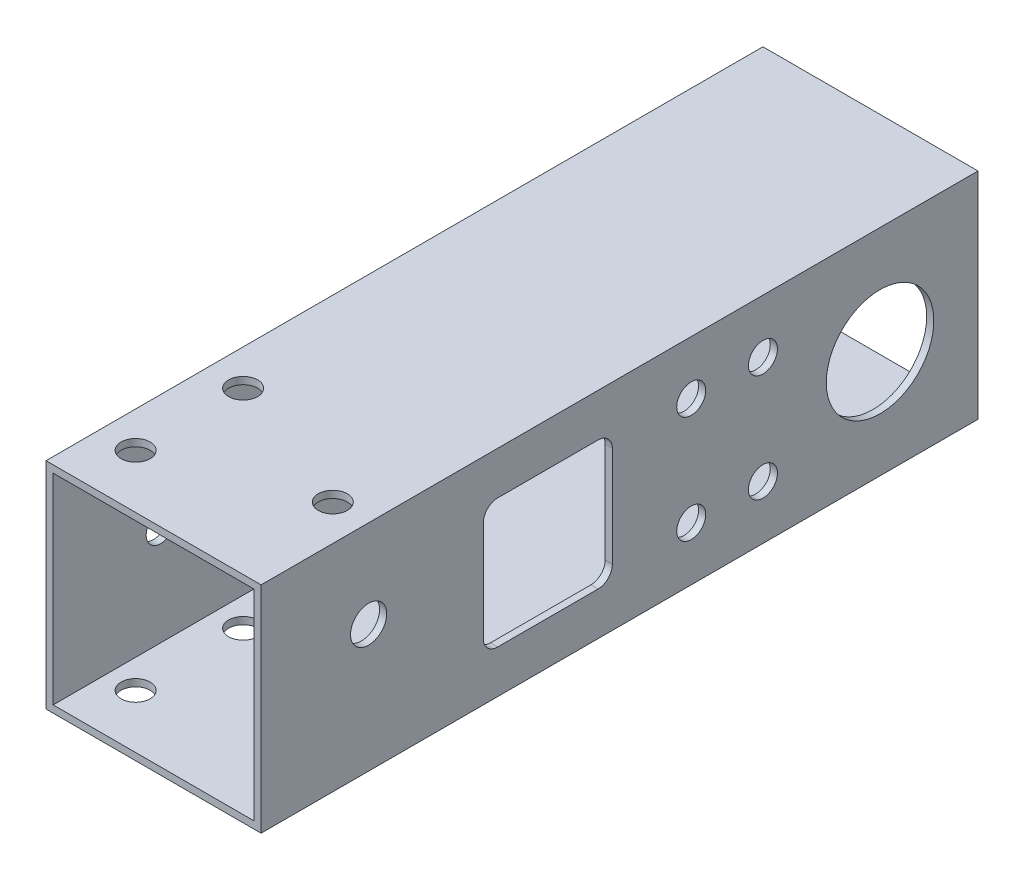
ISO-10303-21;
HEADER;
FILE_DESCRIPTION(('STEP AP214'),'2;1');
FILE_NAME('part.step','',(''),(''),'','','');
FILE_SCHEMA(('AUTOMOTIVE_DESIGN { 1 0 10303 214 1 1 1 1 }'));
ENDSEC;
DATA;
#1=APPLICATION_CONTEXT('core data for automotive mechanical design processes');
#2=APPLICATION_PROTOCOL_DEFINITION('international standard','automotive_design',2000,#1);
#3=PRODUCT_CONTEXT('',#1,'mechanical');
#4=PRODUCT('Part','Part','',(#3));
#5=PRODUCT_RELATED_PRODUCT_CATEGORY('part','',(#4));
#6=PRODUCT_DEFINITION_FORMATION('','',#4);
#7=PRODUCT_DEFINITION_CONTEXT('part definition',#1,'design');
#8=PRODUCT_DEFINITION('design','',#6,#7);
#9=PRODUCT_DEFINITION_SHAPE('','',#8);
#10=(LENGTH_UNIT() NAMED_UNIT(*) SI_UNIT(.MILLI.,.METRE.));
#11=(NAMED_UNIT(*) PLANE_ANGLE_UNIT() SI_UNIT($,.RADIAN.));
#12=(NAMED_UNIT(*) SI_UNIT($,.STERADIAN.) SOLID_ANGLE_UNIT());
#13=UNCERTAINTY_MEASURE_WITH_UNIT(LENGTH_MEASURE(1.E-05),#10,'distance_accuracy_value','');
#14=(GEOMETRIC_REPRESENTATION_CONTEXT(3) GLOBAL_UNCERTAINTY_ASSIGNED_CONTEXT((#13)) GLOBAL_UNIT_ASSIGNED_CONTEXT((#10,
#11,#12)) REPRESENTATION_CONTEXT('',''));
#15=CARTESIAN_POINT('',(0.,0.,0.));
#16=DIRECTION('',(0.,0.,1.));
#17=DIRECTION('',(1.,0.,0.));
#18=AXIS2_PLACEMENT_3D('',#15,#16,#17);
#19=CARTESIAN_POINT('',(15.,-15.,50.));
#20=DIRECTION('',(-1.,0.,0.));
#21=DIRECTION('',(0.,0.,1.));
#22=AXIS2_PLACEMENT_3D('',#19,#20,#21);
#23=PLANE('',#22);
#24=CARTESIAN_POINT('',(15.,2.75,35.));
#25=DIRECTION('',(1.,0.,0.));
#26=DIRECTION('',(0.,0.,-1.));
#27=AXIS2_PLACEMENT_3D('',#24,#25,#26);
#28=CIRCLE('',#27,2.525);
#29=CARTESIAN_POINT('',(15.,2.75,32.475));
#30=VERTEX_POINT('',#29);
#31=EDGE_CURVE('E765',#30,#30,#28,.T.);
#32=ORIENTED_EDGE('',*,*,#31,.F.);
#33=EDGE_LOOP('',(#32));
#34=FACE_BOUND('',#33,.T.);
#35=CARTESIAN_POINT('',(15.,7.50000000000101,-10.0000000000182));
#36=DIRECTION('',(-1.,0.,0.));
#37=DIRECTION('',(0.,0.,1.));
#38=AXIS2_PLACEMENT_3D('',#35,#36,#37);
#39=CIRCLE('',#38,2.025);
#40=CARTESIAN_POINT('',(15.,7.50000000000101,-7.9750000000182));
#41=VERTEX_POINT('',#40);
#42=EDGE_CURVE('E289',#41,#41,#39,.T.);
#43=ORIENTED_EDGE('',*,*,#42,.T.);
#44=EDGE_LOOP('',(#43));
#45=FACE_BOUND('',#44,.T.);
#46=CARTESIAN_POINT('',(15.,-7.49999999999899,-10.0000000000182));
#47=DIRECTION('',(-1.,0.,0.));
#48=DIRECTION('',(0.,0.,1.));
#49=AXIS2_PLACEMENT_3D('',#46,#47,#48);
#50=CIRCLE('',#49,2.025);
#51=CARTESIAN_POINT('',(15.,-7.49999999999899,-7.9750000000182));
#52=VERTEX_POINT('',#51);
#53=EDGE_CURVE('E781',#52,#52,#50,.T.);
#54=ORIENTED_EDGE('',*,*,#53,.T.);
#55=EDGE_LOOP('',(#54));
#56=FACE_BOUND('',#55,.T.);
#57=CARTESIAN_POINT('',(15.,0.,-36.3414768572115));
#58=DIRECTION('',(-1.,0.,0.));
#59=DIRECTION('',(0.,0.,1.));
#60=AXIS2_PLACEMENT_3D('',#57,#58,#59);
#61=CIRCLE('',#60,7.5);
#62=CARTESIAN_POINT('',(15.,0.,-28.8414768572115));
#63=VERTEX_POINT('',#62);
#64=EDGE_CURVE('E285',#63,#63,#61,.T.);
#65=ORIENTED_EDGE('',*,*,#64,.T.);
#66=EDGE_LOOP('',(#65));
#67=FACE_BOUND('',#66,.T.);
#68=CARTESIAN_POINT('',(15.,-7.49999999999899,-20.0000000000182));
#69=DIRECTION('',(-1.,0.,0.));
#70=DIRECTION('',(0.,0.,1.));
#71=AXIS2_PLACEMENT_3D('',#68,#69,#70);
#72=CIRCLE('',#71,2.025);
#73=CARTESIAN_POINT('',(15.,-7.49999999999899,-17.9750000000182));
#74=VERTEX_POINT('',#73);
#75=EDGE_CURVE('E275',#74,#74,#72,.T.);
#76=ORIENTED_EDGE('',*,*,#75,.T.);
#77=EDGE_LOOP('',(#76));
#78=FACE_BOUND('',#77,.T.);
#79=CARTESIAN_POINT('',(15.,7.50000000000101,-20.0000000000182));
#80=DIRECTION('',(-1.,0.,0.));
#81=DIRECTION('',(0.,0.,1.));
#82=AXIS2_PLACEMENT_3D('',#79,#80,#81);
#83=CIRCLE('',#82,2.025);
#84=CARTESIAN_POINT('',(15.,7.50000000000101,-17.9750000000182));
#85=VERTEX_POINT('',#84);
#86=EDGE_CURVE('E316',#85,#85,#83,.T.);
#87=ORIENTED_EDGE('',*,*,#86,.T.);
#88=EDGE_LOOP('',(#87));
#89=FACE_BOUND('',#88,.T.);
#90=DIRECTION('',(0.,0.,-1.));
#91=VECTOR('',#90,1.);
#92=CARTESIAN_POINT('',(15.,-8.99999999999998,0.99999999999998));
#93=LINE('',#92,#91);
#94=CARTESIAN_POINT('',(15.,-8.99999999999998,17.));
#95=VERTEX_POINT('',#94);
#96=CARTESIAN_POINT('',(15.,-8.99999999999998,2.99999999999998));
#97=VERTEX_POINT('',#96);
#98=EDGE_CURVE('E349',#95,#97,#93,.T.);
#99=ORIENTED_EDGE('',*,*,#98,.F.);
#100=CARTESIAN_POINT('',(15.,-6.99999999999998,17.));
#101=DIRECTION('',(-1.,0.,0.));
#102=DIRECTION('',(0.,0.,1.));
#103=AXIS2_PLACEMENT_3D('',#100,#101,#102);
#104=CIRCLE('',#103,2.);
#105=CARTESIAN_POINT('',(15.,-6.99999999999998,19.));
#106=VERTEX_POINT('',#105);
#107=EDGE_CURVE('E259',#95,#106,#104,.T.);
#108=ORIENTED_EDGE('',*,*,#107,.T.);
#109=DIRECTION('',(0.,-1.,0.));
#110=VECTOR('',#109,1.);
#111=CARTESIAN_POINT('',(15.,-8.99999999999998,19.));
#112=LINE('',#111,#110);
#113=CARTESIAN_POINT('',(15.,7.,19.));
#114=VERTEX_POINT('',#113);
#115=EDGE_CURVE('E353',#114,#106,#112,.T.);
#116=ORIENTED_EDGE('',*,*,#115,.F.);
#117=CARTESIAN_POINT('',(15.,7.,17.));
#118=DIRECTION('',(-1.,0.,0.));
#119=DIRECTION('',(0.,0.,1.));
#120=AXIS2_PLACEMENT_3D('',#117,#118,#119);
#121=CIRCLE('',#120,2.);
#122=CARTESIAN_POINT('',(15.,9.,17.));
#123=VERTEX_POINT('',#122);
#124=EDGE_CURVE('E256',#114,#123,#121,.T.);
#125=ORIENTED_EDGE('',*,*,#124,.T.);
#126=DIRECTION('',(0.,0.,1.));
#127=VECTOR('',#126,1.);
#128=CARTESIAN_POINT('',(15.,9.,0.99999999999998));
#129=LINE('',#128,#127);
#130=CARTESIAN_POINT('',(15.,9.,2.99999999999998));
#131=VERTEX_POINT('',#130);
#132=EDGE_CURVE('E356',#131,#123,#129,.T.);
#133=ORIENTED_EDGE('',*,*,#132,.F.);
#134=CARTESIAN_POINT('',(15.,7.,2.99999999999998));
#135=DIRECTION('',(-1.,0.,0.));
#136=DIRECTION('',(0.,0.,1.));
#137=AXIS2_PLACEMENT_3D('',#134,#135,#136);
#138=CIRCLE('',#137,2.);
#139=CARTESIAN_POINT('',(15.,7.,0.99999999999998));
#140=VERTEX_POINT('',#139);
#141=EDGE_CURVE('E11',#131,#140,#138,.T.);
#142=ORIENTED_EDGE('',*,*,#141,.T.);
#143=DIRECTION('',(0.,1.,0.));
#144=VECTOR('',#143,1.);
#145=CARTESIAN_POINT('',(15.,-8.99999999999998,0.99999999999998));
#146=LINE('',#145,#144);
#147=CARTESIAN_POINT('',(15.,-6.99999999999998,0.99999999999998));
#148=VERTEX_POINT('',#147);
#149=EDGE_CURVE('E346',#148,#140,#146,.T.);
#150=ORIENTED_EDGE('',*,*,#149,.F.);
#151=CARTESIAN_POINT('',(15.,-6.99999999999998,2.99999999999998));
#152=DIRECTION('',(-1.,0.,0.));
#153=DIRECTION('',(0.,0.,1.));
#154=AXIS2_PLACEMENT_3D('',#151,#152,#153);
#155=CIRCLE('',#154,2.);
#156=EDGE_CURVE('E253',#148,#97,#155,.T.);
#157=ORIENTED_EDGE('',*,*,#156,.T.);
#158=EDGE_LOOP('',(#99,#108,#116,#125,#133,#142,#150,#157));
#159=FACE_BOUND('',#158,.T.);
#160=DIRECTION('',(0.,1.,0.));
#161=VECTOR('',#160,1.);
#162=CARTESIAN_POINT('',(15.,-15.,-50.));
#163=LINE('',#162,#161);
#164=CARTESIAN_POINT('',(15.,-15.,-50.));
#165=VERTEX_POINT('',#164);
#166=CARTESIAN_POINT('',(15.,15.,-50.));
#167=VERTEX_POINT('',#166);
#168=EDGE_CURVE('E202',#165,#167,#163,.T.);
#169=ORIENTED_EDGE('',*,*,#168,.T.);
#170=DIRECTION('',(0.,0.,-1.));
#171=VECTOR('',#170,1.);
#172=CARTESIAN_POINT('',(15.,15.,50.));
#173=LINE('',#172,#171);
#174=CARTESIAN_POINT('',(15.,15.,50.));
#175=VERTEX_POINT('',#174);
#176=EDGE_CURVE('E229',#175,#167,#173,.T.);
#177=ORIENTED_EDGE('',*,*,#176,.F.);
#178=DIRECTION('',(0.,1.,0.));
#179=VECTOR('',#178,1.);
#180=CARTESIAN_POINT('',(15.,-15.,50.));
#181=LINE('',#180,#179);
#182=CARTESIAN_POINT('',(15.,-15.,50.));
#183=VERTEX_POINT('',#182);
#184=EDGE_CURVE('E203',#183,#175,#181,.T.);
#185=ORIENTED_EDGE('',*,*,#184,.F.);
#186=DIRECTION('',(0.,0.,-1.));
#187=VECTOR('',#186,1.);
#188=CARTESIAN_POINT('',(15.,-15.,50.));
#189=LINE('',#188,#187);
#190=EDGE_CURVE('E213',#183,#165,#189,.T.);
#191=ORIENTED_EDGE('',*,*,#190,.T.);
#192=EDGE_LOOP('',(#169,#177,#185,#191));
#193=FACE_BOUND('',#192,.T.);
#194=ADVANCED_FACE('F34',(#34,#45,#56,#67,#78,#89,#159,#193),#23,.F.);
#195=CARTESIAN_POINT('',(-15.,15.,50.));
#196=DIRECTION('',(0.,-1.,0.));
#197=DIRECTION('',(0.,0.,-1.));
#198=AXIS2_PLACEMENT_3D('',#195,#196,#197);
#199=PLANE('',#198);
#200=CARTESIAN_POINT('',(10.,15.,35.));
#201=DIRECTION('',(0.,-1.,0.));
#202=DIRECTION('',(0.,0.,-1.));
#203=AXIS2_PLACEMENT_3D('',#200,#201,#202);
#204=CIRCLE('',#203,2.025);
#205=CARTESIAN_POINT('',(10.,15.,32.975));
#206=VERTEX_POINT('',#205);
#207=EDGE_CURVE('E778',#206,#206,#204,.T.);
#208=ORIENTED_EDGE('',*,*,#207,.T.);
#209=EDGE_LOOP('',(#208));
#210=FACE_BOUND('',#209,.T.);
#211=CARTESIAN_POINT('',(-9.99999999999999,15.,27.5));
#212=DIRECTION('',(0.,1.,0.));
#213=DIRECTION('',(0.,0.,1.));
#214=AXIS2_PLACEMENT_3D('',#211,#212,#213);
#215=CIRCLE('',#214,2.025);
#216=CARTESIAN_POINT('',(-9.99999999999999,15.,29.525));
#217=VERTEX_POINT('',#216);
#218=EDGE_CURVE('E331',#217,#217,#215,.T.);
#219=ORIENTED_EDGE('',*,*,#218,.F.);
#220=EDGE_LOOP('',(#219));
#221=FACE_BOUND('',#220,.T.);
#222=CARTESIAN_POINT('',(-9.99999999999999,15.,42.5));
#223=DIRECTION('',(0.,1.,0.));
#224=DIRECTION('',(0.,0.,1.));
#225=AXIS2_PLACEMENT_3D('',#222,#223,#224);
#226=CIRCLE('',#225,2.025);
#227=CARTESIAN_POINT('',(-9.99999999999999,15.,44.525));
#228=VERTEX_POINT('',#227);
#229=EDGE_CURVE('E334',#228,#228,#226,.T.);
#230=ORIENTED_EDGE('',*,*,#229,.F.);
#231=EDGE_LOOP('',(#230));
#232=FACE_BOUND('',#231,.T.);
#233=DIRECTION('',(-1.,0.,0.));
#234=VECTOR('',#233,1.);
#235=CARTESIAN_POINT('',(-15.,15.,-50.));
#236=LINE('',#235,#234);
#237=CARTESIAN_POINT('',(-15.,15.,-50.));
#238=VERTEX_POINT('',#237);
#239=EDGE_CURVE('E216',#167,#238,#236,.T.);
#240=ORIENTED_EDGE('',*,*,#239,.T.);
#241=DIRECTION('',(0.,0.,-1.));
#242=VECTOR('',#241,1.);
#243=CARTESIAN_POINT('',(-15.,15.,50.));
#244=LINE('',#243,#242);
#245=CARTESIAN_POINT('',(-15.,15.,50.));
#246=VERTEX_POINT('',#245);
#247=EDGE_CURVE('E226',#246,#238,#244,.T.);
#248=ORIENTED_EDGE('',*,*,#247,.F.);
#249=DIRECTION('',(-1.,0.,0.));
#250=VECTOR('',#249,1.);
#251=CARTESIAN_POINT('',(-15.,15.,50.));
#252=LINE('',#251,#250);
#253=EDGE_CURVE('E206',#175,#246,#252,.T.);
#254=ORIENTED_EDGE('',*,*,#253,.F.);
#255=ORIENTED_EDGE('',*,*,#176,.T.);
#256=EDGE_LOOP('',(#240,#248,#254,#255));
#257=FACE_BOUND('',#256,.T.);
#258=ADVANCED_FACE('F401',(#210,#221,#232,#257),#199,.F.);
#259=CARTESIAN_POINT('',(-15.,-15.,50.));
#260=DIRECTION('',(1.,0.,0.));
#261=DIRECTION('',(0.,0.,-1.));
#262=AXIS2_PLACEMENT_3D('',#259,#260,#261);
#263=PLANE('',#262);
#264=CARTESIAN_POINT('',(-15.,7.50000000000101,-10.0000000000182));
#265=DIRECTION('',(1.,0.,0.));
#266=DIRECTION('',(0.,0.,-1.));
#267=AXIS2_PLACEMENT_3D('',#264,#265,#266);
#268=CIRCLE('',#267,2.025);
#269=CARTESIAN_POINT('',(-15.,7.50000000000101,-12.0250000000182));
#270=VERTEX_POINT('',#269);
#271=EDGE_CURVE('E297',#270,#270,#268,.T.);
#272=ORIENTED_EDGE('',*,*,#271,.T.);
#273=EDGE_LOOP('',(#272));
#274=FACE_BOUND('',#273,.T.);
#275=CARTESIAN_POINT('',(-15.,-7.49999999999899,-10.0000000000182));
#276=DIRECTION('',(1.,0.,0.));
#277=DIRECTION('',(0.,0.,-1.));
#278=AXIS2_PLACEMENT_3D('',#275,#276,#277);
#279=CIRCLE('',#278,2.025);
#280=CARTESIAN_POINT('',(-15.,-7.49999999999899,-12.0250000000182));
#281=VERTEX_POINT('',#280);
#282=EDGE_CURVE('E293',#281,#281,#279,.T.);
#283=ORIENTED_EDGE('',*,*,#282,.T.);
#284=EDGE_LOOP('',(#283));
#285=FACE_BOUND('',#284,.T.);
#286=CARTESIAN_POINT('',(-15.,0.,-36.3414768572115));
#287=DIRECTION('',(-1.,0.,0.));
#288=DIRECTION('',(0.,0.,1.));
#289=AXIS2_PLACEMENT_3D('',#286,#287,#288);
#290=CIRCLE('',#289,7.5);
#291=CARTESIAN_POINT('',(-15.,0.,-28.8414768572115));
#292=VERTEX_POINT('',#291);
#293=EDGE_CURVE('E309',#292,#292,#290,.T.);
#294=ORIENTED_EDGE('',*,*,#293,.F.);
#295=EDGE_LOOP('',(#294));
#296=FACE_BOUND('',#295,.T.);
#297=CARTESIAN_POINT('',(-15.,-7.49999999999899,-20.0000000000182));
#298=DIRECTION('',(1.,0.,0.));
#299=DIRECTION('',(0.,0.,-1.));
#300=AXIS2_PLACEMENT_3D('',#297,#298,#299);
#301=CIRCLE('',#300,2.025);
#302=CARTESIAN_POINT('',(-15.,-7.49999999999899,-22.0250000000182));
#303=VERTEX_POINT('',#302);
#304=EDGE_CURVE('E327',#303,#303,#301,.T.);
#305=ORIENTED_EDGE('',*,*,#304,.T.);
#306=EDGE_LOOP('',(#305));
#307=FACE_BOUND('',#306,.T.);
#308=CARTESIAN_POINT('',(-15.,7.50000000000101,-20.0000000000182));
#309=DIRECTION('',(1.,0.,0.));
#310=DIRECTION('',(0.,0.,-1.));
#311=AXIS2_PLACEMENT_3D('',#308,#309,#310);
#312=CIRCLE('',#311,2.025);
#313=CARTESIAN_POINT('',(-15.,7.50000000000101,-22.0250000000182));
#314=VERTEX_POINT('',#313);
#315=EDGE_CURVE('E280',#314,#314,#312,.T.);
#316=ORIENTED_EDGE('',*,*,#315,.T.);
#317=EDGE_LOOP('',(#316));
#318=FACE_BOUND('',#317,.T.);
#319=CARTESIAN_POINT('',(-15.,0.,9.99999999999997));
#320=DIRECTION('',(-1.,0.,0.));
#321=DIRECTION('',(0.,0.,1.));
#322=AXIS2_PLACEMENT_3D('',#319,#320,#321);
#323=CIRCLE('',#322,2.025);
#324=CARTESIAN_POINT('',(-15.,0.,12.025));
#325=VERTEX_POINT('',#324);
#326=EDGE_CURVE('E179',#325,#325,#323,.T.);
#327=ORIENTED_EDGE('',*,*,#326,.F.);
#328=EDGE_LOOP('',(#327));
#329=FACE_BOUND('',#328,.T.);
#330=CARTESIAN_POINT('',(-15.,0.,35.));
#331=DIRECTION('',(-1.,0.,0.));
#332=DIRECTION('',(0.,0.,1.));
#333=AXIS2_PLACEMENT_3D('',#330,#331,#332);
#334=CIRCLE('',#333,2.02499999999999);
#335=CARTESIAN_POINT('',(-15.,0.,37.025));
#336=VERTEX_POINT('',#335);
#337=EDGE_CURVE('E368',#336,#336,#334,.T.);
#338=ORIENTED_EDGE('',*,*,#337,.F.);
#339=EDGE_LOOP('',(#338));
#340=FACE_BOUND('',#339,.T.);
#341=DIRECTION('',(0.,-1.,0.));
#342=VECTOR('',#341,1.);
#343=CARTESIAN_POINT('',(-15.,-15.,-50.));
#344=LINE('',#343,#342);
#345=CARTESIAN_POINT('',(-15.,-15.,-50.));
#346=VERTEX_POINT('',#345);
#347=EDGE_CURVE('E218',#238,#346,#344,.T.);
#348=ORIENTED_EDGE('',*,*,#347,.T.);
#349=DIRECTION('',(0.,0.,-1.));
#350=VECTOR('',#349,1.);
#351=CARTESIAN_POINT('',(-15.,-15.,50.));
#352=LINE('',#351,#350);
#353=CARTESIAN_POINT('',(-15.,-15.,50.));
#354=VERTEX_POINT('',#353);
#355=EDGE_CURVE('E223',#354,#346,#352,.T.);
#356=ORIENTED_EDGE('',*,*,#355,.F.);
#357=DIRECTION('',(0.,-1.,0.));
#358=VECTOR('',#357,1.);
#359=CARTESIAN_POINT('',(-15.,-15.,50.));
#360=LINE('',#359,#358);
#361=EDGE_CURVE('E209',#246,#354,#360,.T.);
#362=ORIENTED_EDGE('',*,*,#361,.F.);
#363=ORIENTED_EDGE('',*,*,#247,.T.);
#364=EDGE_LOOP('',(#348,#356,#362,#363));
#365=FACE_BOUND('',#364,.T.);
#366=ADVANCED_FACE('F408',(#274,#285,#296,#307,#318,#329,#340,#365),#263,.F.);
#367=CARTESIAN_POINT('',(-15.,-15.,50.));
#368=DIRECTION('',(0.,1.,0.));
#369=DIRECTION('',(0.,0.,1.));
#370=AXIS2_PLACEMENT_3D('',#367,#368,#369);
#371=PLANE('',#370);
#372=CARTESIAN_POINT('',(10.,-15.,35.));
#373=DIRECTION('',(0.,1.,0.));
#374=DIRECTION('',(0.,0.,1.));
#375=AXIS2_PLACEMENT_3D('',#372,#373,#374);
#376=CIRCLE('',#375,2.025);
#377=CARTESIAN_POINT('',(10.,-15.,37.025));
#378=VERTEX_POINT('',#377);
#379=EDGE_CURVE('E769',#378,#378,#376,.T.);
#380=ORIENTED_EDGE('',*,*,#379,.T.);
#381=EDGE_LOOP('',(#380));
#382=FACE_BOUND('',#381,.T.);
#383=CARTESIAN_POINT('',(-9.99999999999999,-15.,27.5));
#384=DIRECTION('',(0.,1.,0.));
#385=DIRECTION('',(0.,0.,1.));
#386=AXIS2_PLACEMENT_3D('',#383,#384,#385);
#387=CIRCLE('',#386,2.025);
#388=CARTESIAN_POINT('',(-9.99999999999999,-15.,29.525));
#389=VERTEX_POINT('',#388);
#390=EDGE_CURVE('E266',#389,#389,#387,.T.);
#391=ORIENTED_EDGE('',*,*,#390,.T.);
#392=EDGE_LOOP('',(#391));
#393=FACE_BOUND('',#392,.T.);
#394=CARTESIAN_POINT('',(-9.99999999999999,-15.,42.5));
#395=DIRECTION('',(0.,1.,0.));
#396=DIRECTION('',(0.,0.,1.));
#397=AXIS2_PLACEMENT_3D('',#394,#395,#396);
#398=CIRCLE('',#397,2.025);
#399=CARTESIAN_POINT('',(-9.99999999999999,-15.,44.525));
#400=VERTEX_POINT('',#399);
#401=EDGE_CURVE('E330',#400,#400,#398,.T.);
#402=ORIENTED_EDGE('',*,*,#401,.T.);
#403=EDGE_LOOP('',(#402));
#404=FACE_BOUND('',#403,.T.);
#405=DIRECTION('',(1.,0.,0.));
#406=VECTOR('',#405,1.);
#407=CARTESIAN_POINT('',(-15.,-15.,-50.));
#408=LINE('',#407,#406);
#409=EDGE_CURVE('E207',#346,#165,#408,.T.);
#410=ORIENTED_EDGE('',*,*,#409,.T.);
#411=ORIENTED_EDGE('',*,*,#190,.F.);
#412=DIRECTION('',(1.,0.,0.));
#413=VECTOR('',#412,1.);
#414=CARTESIAN_POINT('',(-15.,-15.,50.));
#415=LINE('',#414,#413);
#416=EDGE_CURVE('E211',#354,#183,#415,.T.);
#417=ORIENTED_EDGE('',*,*,#416,.F.);
#418=ORIENTED_EDGE('',*,*,#355,.T.);
#419=EDGE_LOOP('',(#410,#411,#417,#418));
#420=FACE_BOUND('',#419,.T.);
#421=ADVANCED_FACE('F628',(#382,#393,#404,#420),#371,.F.);
#422=CARTESIAN_POINT('',(0.,0.,50.));
#423=DIRECTION('',(0.,0.,-1.));
#424=DIRECTION('',(-1.,0.,0.));
#425=AXIS2_PLACEMENT_3D('',#422,#423,#424);
#426=PLANE('',#425);
#427=DIRECTION('',(0.,-1.,0.));
#428=VECTOR('',#427,1.);
#429=CARTESIAN_POINT('',(14.,0.,50.));
#430=LINE('',#429,#428);
#431=CARTESIAN_POINT('',(14.,14.,50.));
#432=VERTEX_POINT('',#431);
#433=CARTESIAN_POINT('',(14.,-14.,50.));
#434=VERTEX_POINT('',#433);
#435=EDGE_CURVE('E189',#432,#434,#430,.T.);
#436=ORIENTED_EDGE('',*,*,#435,.T.);
#437=DIRECTION('',(-1.,0.,0.));
#438=VECTOR('',#437,1.);
#439=CARTESIAN_POINT('',(0.,-14.,50.));
#440=LINE('',#439,#438);
#441=CARTESIAN_POINT('',(-14.,-14.,50.));
#442=VERTEX_POINT('',#441);
#443=EDGE_CURVE('E158',#434,#442,#440,.T.);
#444=ORIENTED_EDGE('',*,*,#443,.T.);
#445=DIRECTION('',(0.,1.,0.));
#446=VECTOR('',#445,1.);
#447=CARTESIAN_POINT('',(-14.,0.,50.));
#448=LINE('',#447,#446);
#449=CARTESIAN_POINT('',(-14.,14.,50.));
#450=VERTEX_POINT('',#449);
#451=EDGE_CURVE('E198',#442,#450,#448,.T.);
#452=ORIENTED_EDGE('',*,*,#451,.T.);
#453=DIRECTION('',(1.,0.,0.));
#454=VECTOR('',#453,1.);
#455=CARTESIAN_POINT('',(0.,14.,50.));
#456=LINE('',#455,#454);
#457=EDGE_CURVE('E195',#450,#432,#456,.T.);
#458=ORIENTED_EDGE('',*,*,#457,.T.);
#459=EDGE_LOOP('',(#436,#444,#452,#458));
#460=FACE_BOUND('',#459,.T.);
#461=ORIENTED_EDGE('',*,*,#184,.T.);
#462=ORIENTED_EDGE('',*,*,#253,.T.);
#463=ORIENTED_EDGE('',*,*,#361,.T.);
#464=ORIENTED_EDGE('',*,*,#416,.T.);
#465=EDGE_LOOP('',(#461,#462,#463,#464));
#466=FACE_BOUND('',#465,.T.);
#467=ADVANCED_FACE('F385',(#460,#466),#426,.F.);
#468=CARTESIAN_POINT('',(0.,0.,-50.));
#469=DIRECTION('',(0.,0.,-1.));
#470=DIRECTION('',(-1.,0.,0.));
#471=AXIS2_PLACEMENT_3D('',#468,#469,#470);
#472=PLANE('',#471);
#473=DIRECTION('',(1.,0.,0.));
#474=VECTOR('',#473,1.);
#475=CARTESIAN_POINT('',(-14.,-14.,-50.));
#476=LINE('',#475,#474);
#477=CARTESIAN_POINT('',(-14.,-14.,-50.));
#478=VERTEX_POINT('',#477);
#479=CARTESIAN_POINT('',(14.,-14.,-50.));
#480=VERTEX_POINT('',#479);
#481=EDGE_CURVE('E155',#478,#480,#476,.T.);
#482=ORIENTED_EDGE('',*,*,#481,.T.);
#483=DIRECTION('',(0.,1.,0.));
#484=VECTOR('',#483,1.);
#485=CARTESIAN_POINT('',(14.,-14.,-50.));
#486=LINE('',#485,#484);
#487=CARTESIAN_POINT('',(14.,14.,-50.));
#488=VERTEX_POINT('',#487);
#489=EDGE_CURVE('E166',#480,#488,#486,.T.);
#490=ORIENTED_EDGE('',*,*,#489,.T.);
#491=DIRECTION('',(-1.,0.,0.));
#492=VECTOR('',#491,1.);
#493=CARTESIAN_POINT('',(14.,14.,-50.));
#494=LINE('',#493,#492);
#495=CARTESIAN_POINT('',(-14.,14.,-50.));
#496=VERTEX_POINT('',#495);
#497=EDGE_CURVE('E171',#488,#496,#494,.T.);
#498=ORIENTED_EDGE('',*,*,#497,.T.);
#499=DIRECTION('',(0.,-1.,0.));
#500=VECTOR('',#499,1.);
#501=CARTESIAN_POINT('',(-14.,14.,-50.));
#502=LINE('',#501,#500);
#503=EDGE_CURVE('E162',#496,#478,#502,.T.);
#504=ORIENTED_EDGE('',*,*,#503,.T.);
#505=EDGE_LOOP('',(#482,#490,#498,#504));
#506=FACE_BOUND('',#505,.T.);
#507=ORIENTED_EDGE('',*,*,#168,.F.);
#508=ORIENTED_EDGE('',*,*,#409,.F.);
#509=ORIENTED_EDGE('',*,*,#347,.F.);
#510=ORIENTED_EDGE('',*,*,#239,.F.);
#511=EDGE_LOOP('',(#507,#508,#509,#510));
#512=FACE_BOUND('',#511,.T.);
#513=ADVANCED_FACE('F173',(#506,#512),#472,.T.);
#514=CARTESIAN_POINT('',(-14.,-14.,-50.));
#515=DIRECTION('',(0.,-1.,0.));
#516=DIRECTION('',(0.,0.,-1.));
#517=AXIS2_PLACEMENT_3D('',#514,#515,#516);
#518=PLANE('',#517);
#519=CARTESIAN_POINT('',(10.,-14.,35.));
#520=DIRECTION('',(0.,-1.,0.));
#521=DIRECTION('',(0.,0.,-1.));
#522=AXIS2_PLACEMENT_3D('',#519,#520,#521);
#523=CIRCLE('',#522,2.025);
#524=CARTESIAN_POINT('',(10.,-14.,32.975));
#525=VERTEX_POINT('',#524);
#526=EDGE_CURVE('E775',#525,#525,#523,.T.);
#527=ORIENTED_EDGE('',*,*,#526,.T.);
#528=EDGE_LOOP('',(#527));
#529=FACE_BOUND('',#528,.T.);
#530=CARTESIAN_POINT('',(-9.99999999999999,-14.,27.5));
#531=DIRECTION('',(0.,-1.,0.));
#532=DIRECTION('',(0.,0.,-1.));
#533=AXIS2_PLACEMENT_3D('',#530,#531,#532);
#534=CIRCLE('',#533,2.025);
#535=CARTESIAN_POINT('',(-9.99999999999999,-14.,25.475));
#536=VERTEX_POINT('',#535);
#537=EDGE_CURVE('E270',#536,#536,#534,.T.);
#538=ORIENTED_EDGE('',*,*,#537,.T.);
#539=EDGE_LOOP('',(#538));
#540=FACE_BOUND('',#539,.T.);
#541=CARTESIAN_POINT('',(-9.99999999999999,-14.,42.5));
#542=DIRECTION('',(0.,-1.,0.));
#543=DIRECTION('',(0.,0.,-1.));
#544=AXIS2_PLACEMENT_3D('',#541,#542,#543);
#545=CIRCLE('',#544,2.025);
#546=CARTESIAN_POINT('',(-9.99999999999999,-14.,40.475));
#547=VERTEX_POINT('',#546);
#548=EDGE_CURVE('E265',#547,#547,#545,.T.);
#549=ORIENTED_EDGE('',*,*,#548,.T.);
#550=EDGE_LOOP('',(#549));
#551=FACE_BOUND('',#550,.T.);
#552=DIRECTION('',(0.,0.,1.));
#553=VECTOR('',#552,1.);
#554=CARTESIAN_POINT('',(14.,-14.,-50.));
#555=LINE('',#554,#553);
#556=EDGE_CURVE('E150',#480,#434,#555,.T.);
#557=ORIENTED_EDGE('',*,*,#556,.F.);
#558=ORIENTED_EDGE('',*,*,#481,.F.);
#559=DIRECTION('',(0.,0.,1.));
#560=VECTOR('',#559,1.);
#561=CARTESIAN_POINT('',(-14.,-14.,-50.));
#562=LINE('',#561,#560);
#563=EDGE_CURVE('E187',#478,#442,#562,.T.);
#564=ORIENTED_EDGE('',*,*,#563,.T.);
#565=ORIENTED_EDGE('',*,*,#443,.F.);
#566=EDGE_LOOP('',(#557,#558,#564,#565));
#567=FACE_BOUND('',#566,.T.);
#568=ADVANCED_FACE('F152',(#529,#540,#551,#567),#518,.F.);
#569=CARTESIAN_POINT('',(-14.,14.,-50.));
#570=DIRECTION('',(-1.,0.,0.));
#571=DIRECTION('',(0.,0.,1.));
#572=AXIS2_PLACEMENT_3D('',#569,#570,#571);
#573=PLANE('',#572);
#574=CARTESIAN_POINT('',(-14.,7.50000000000101,-10.0000000000182));
#575=DIRECTION('',(-1.,0.,0.));
#576=DIRECTION('',(0.,0.,1.));
#577=AXIS2_PLACEMENT_3D('',#574,#575,#576);
#578=CIRCLE('',#577,2.025);
#579=CARTESIAN_POINT('',(-14.,7.50000000000101,-7.9750000000182));
#580=VERTEX_POINT('',#579);
#581=EDGE_CURVE('E292',#580,#580,#578,.T.);
#582=ORIENTED_EDGE('',*,*,#581,.T.);
#583=EDGE_LOOP('',(#582));
#584=FACE_BOUND('',#583,.T.);
#585=CARTESIAN_POINT('',(-14.,-7.49999999999899,-10.0000000000182));
#586=DIRECTION('',(-1.,0.,0.));
#587=DIRECTION('',(0.,0.,1.));
#588=AXIS2_PLACEMENT_3D('',#585,#586,#587);
#589=CIRCLE('',#588,2.025);
#590=CARTESIAN_POINT('',(-14.,-7.49999999999899,-7.9750000000182));
#591=VERTEX_POINT('',#590);
#592=EDGE_CURVE('E288',#591,#591,#589,.T.);
#593=ORIENTED_EDGE('',*,*,#592,.T.);
#594=EDGE_LOOP('',(#593));
#595=FACE_BOUND('',#594,.T.);
#596=CARTESIAN_POINT('',(-14.,0.,-36.3414768572115));
#597=DIRECTION('',(-1.,0.,0.));
#598=DIRECTION('',(0.,0.,1.));
#599=AXIS2_PLACEMENT_3D('',#596,#597,#598);
#600=CIRCLE('',#599,7.5);
#601=CARTESIAN_POINT('',(-14.,0.,-28.8414768572115));
#602=VERTEX_POINT('',#601);
#603=EDGE_CURVE('E284',#602,#602,#600,.T.);
#604=ORIENTED_EDGE('',*,*,#603,.T.);
#605=EDGE_LOOP('',(#604));
#606=FACE_BOUND('',#605,.T.);
#607=CARTESIAN_POINT('',(-14.,-7.49999999999899,-20.0000000000182));
#608=DIRECTION('',(-1.,0.,0.));
#609=DIRECTION('',(0.,0.,1.));
#610=AXIS2_PLACEMENT_3D('',#607,#608,#609);
#611=CIRCLE('',#610,2.025);
#612=CARTESIAN_POINT('',(-14.,-7.49999999999899,-17.9750000000182));
#613=VERTEX_POINT('',#612);
#614=EDGE_CURVE('E279',#613,#613,#611,.T.);
#615=ORIENTED_EDGE('',*,*,#614,.T.);
#616=EDGE_LOOP('',(#615));
#617=FACE_BOUND('',#616,.T.);
#618=CARTESIAN_POINT('',(-14.,7.50000000000101,-20.0000000000182));
#619=DIRECTION('',(-1.,0.,0.));
#620=DIRECTION('',(0.,0.,1.));
#621=AXIS2_PLACEMENT_3D('',#618,#619,#620);
#622=CIRCLE('',#621,2.025);
#623=CARTESIAN_POINT('',(-14.,7.50000000000101,-17.9750000000182));
#624=VERTEX_POINT('',#623);
#625=EDGE_CURVE('E274',#624,#624,#622,.T.);
#626=ORIENTED_EDGE('',*,*,#625,.T.);
#627=EDGE_LOOP('',(#626));
#628=FACE_BOUND('',#627,.T.);
#629=CARTESIAN_POINT('',(-14.,0.,9.99999999999997));
#630=DIRECTION('',(-1.,0.,0.));
#631=DIRECTION('',(0.,0.,1.));
#632=AXIS2_PLACEMENT_3D('',#629,#630,#631);
#633=CIRCLE('',#632,2.025);
#634=CARTESIAN_POINT('',(-14.,0.,12.025));
#635=VERTEX_POINT('',#634);
#636=EDGE_CURVE('E176',#635,#635,#633,.F.);
#637=ORIENTED_EDGE('',*,*,#636,.F.);
#638=EDGE_LOOP('',(#637));
#639=FACE_BOUND('',#638,.T.);
#640=CARTESIAN_POINT('',(-14.,0.,35.));
#641=DIRECTION('',(-1.,0.,0.));
#642=DIRECTION('',(0.,0.,1.));
#643=AXIS2_PLACEMENT_3D('',#640,#641,#642);
#644=CIRCLE('',#643,2.02499999999999);
#645=CARTESIAN_POINT('',(-14.,0.,37.025));
#646=VERTEX_POINT('',#645);
#647=EDGE_CURVE('E182',#646,#646,#644,.F.);
#648=ORIENTED_EDGE('',*,*,#647,.F.);
#649=EDGE_LOOP('',(#648));
#650=FACE_BOUND('',#649,.T.);
#651=ORIENTED_EDGE('',*,*,#563,.F.);
#652=ORIENTED_EDGE('',*,*,#503,.F.);
#653=DIRECTION('',(0.,0.,1.));
#654=VECTOR('',#653,1.);
#655=CARTESIAN_POINT('',(-14.,14.,-50.));
#656=LINE('',#655,#654);
#657=EDGE_CURVE('E190',#496,#450,#656,.T.);
#658=ORIENTED_EDGE('',*,*,#657,.T.);
#659=ORIENTED_EDGE('',*,*,#451,.F.);
#660=EDGE_LOOP('',(#651,#652,#658,#659));
#661=FACE_BOUND('',#660,.T.);
#662=ADVANCED_FACE('F378',(#584,#595,#606,#617,#628,#639,#650,#661),#573,.F.);
#663=CARTESIAN_POINT('',(14.,14.,-50.));
#664=DIRECTION('',(0.,1.,0.));
#665=DIRECTION('',(0.,0.,1.));
#666=AXIS2_PLACEMENT_3D('',#663,#664,#665);
#667=PLANE('',#666);
#668=CARTESIAN_POINT('',(10.,14.,35.));
#669=DIRECTION('',(0.,1.,0.));
#670=DIRECTION('',(0.,0.,1.));
#671=AXIS2_PLACEMENT_3D('',#668,#669,#670);
#672=CIRCLE('',#671,2.025);
#673=CARTESIAN_POINT('',(10.,14.,37.025));
#674=VERTEX_POINT('',#673);
#675=EDGE_CURVE('E38',#674,#674,#672,.T.);
#676=ORIENTED_EDGE('',*,*,#675,.T.);
#677=EDGE_LOOP('',(#676));
#678=FACE_BOUND('',#677,.T.);
#679=CARTESIAN_POINT('',(-9.99999999999999,14.,27.5));
#680=DIRECTION('',(0.,1.,0.));
#681=DIRECTION('',(0.,0.,1.));
#682=AXIS2_PLACEMENT_3D('',#679,#680,#681);
#683=CIRCLE('',#682,2.025);
#684=CARTESIAN_POINT('',(-9.99999999999999,14.,29.525));
#685=VERTEX_POINT('',#684);
#686=EDGE_CURVE('E267',#685,#685,#683,.T.);
#687=ORIENTED_EDGE('',*,*,#686,.T.);
#688=EDGE_LOOP('',(#687));
#689=FACE_BOUND('',#688,.T.);
#690=CARTESIAN_POINT('',(-9.99999999999999,14.,42.5));
#691=DIRECTION('',(0.,1.,0.));
#692=DIRECTION('',(0.,0.,1.));
#693=AXIS2_PLACEMENT_3D('',#690,#691,#692);
#694=CIRCLE('',#693,2.025);
#695=CARTESIAN_POINT('',(-9.99999999999999,14.,44.525));
#696=VERTEX_POINT('',#695);
#697=EDGE_CURVE('E262',#696,#696,#694,.T.);
#698=ORIENTED_EDGE('',*,*,#697,.T.);
#699=EDGE_LOOP('',(#698));
#700=FACE_BOUND('',#699,.T.);
#701=ORIENTED_EDGE('',*,*,#657,.F.);
#702=ORIENTED_EDGE('',*,*,#497,.F.);
#703=DIRECTION('',(0.,0.,1.));
#704=VECTOR('',#703,1.);
#705=CARTESIAN_POINT('',(14.,14.,-50.));
#706=LINE('',#705,#704);
#707=EDGE_CURVE('E161',#488,#432,#706,.T.);
#708=ORIENTED_EDGE('',*,*,#707,.T.);
#709=ORIENTED_EDGE('',*,*,#457,.F.);
#710=EDGE_LOOP('',(#701,#702,#708,#709));
#711=FACE_BOUND('',#710,.T.);
#712=ADVANCED_FACE('F381',(#678,#689,#700,#711),#667,.F.);
#713=CARTESIAN_POINT('',(14.,-14.,-50.));
#714=DIRECTION('',(1.,0.,0.));
#715=DIRECTION('',(0.,0.,-1.));
#716=AXIS2_PLACEMENT_3D('',#713,#714,#715);
#717=PLANE('',#716);
#718=CARTESIAN_POINT('',(14.,2.75,35.));
#719=DIRECTION('',(1.,0.,0.));
#720=DIRECTION('',(0.,0.,-1.));
#721=AXIS2_PLACEMENT_3D('',#718,#719,#720);
#722=CIRCLE('',#721,2.525);
#723=CARTESIAN_POINT('',(14.,2.75,32.475));
#724=VERTEX_POINT('',#723);
#725=EDGE_CURVE('E768',#724,#724,#722,.F.);
#726=ORIENTED_EDGE('',*,*,#725,.F.);
#727=EDGE_LOOP('',(#726));
#728=FACE_BOUND('',#727,.T.);
#729=CARTESIAN_POINT('',(14.,7.50000000000101,-10.0000000000182));
#730=DIRECTION('',(1.,0.,0.));
#731=DIRECTION('',(0.,0.,-1.));
#732=AXIS2_PLACEMENT_3D('',#729,#730,#731);
#733=CIRCLE('',#732,2.025);
#734=CARTESIAN_POINT('',(14.,7.50000000000101,-12.0250000000182));
#735=VERTEX_POINT('',#734);
#736=EDGE_CURVE('E290',#735,#735,#733,.T.);
#737=ORIENTED_EDGE('',*,*,#736,.T.);
#738=EDGE_LOOP('',(#737));
#739=FACE_BOUND('',#738,.T.);
#740=CARTESIAN_POINT('',(14.,-7.49999999999899,-10.0000000000182));
#741=DIRECTION('',(1.,0.,0.));
#742=DIRECTION('',(0.,0.,-1.));
#743=AXIS2_PLACEMENT_3D('',#740,#741,#742);
#744=CIRCLE('',#743,2.025);
#745=CARTESIAN_POINT('',(14.,-7.49999999999899,-12.0250000000182));
#746=VERTEX_POINT('',#745);
#747=EDGE_CURVE('E286',#746,#746,#744,.T.);
#748=ORIENTED_EDGE('',*,*,#747,.T.);
#749=EDGE_LOOP('',(#748));
#750=FACE_BOUND('',#749,.T.);
#751=CARTESIAN_POINT('',(14.,0.,-36.3414768572115));
#752=DIRECTION('',(1.,0.,0.));
#753=DIRECTION('',(0.,0.,-1.));
#754=AXIS2_PLACEMENT_3D('',#751,#752,#753);
#755=CIRCLE('',#754,7.5);
#756=CARTESIAN_POINT('',(14.,0.,-43.8414768572115));
#757=VERTEX_POINT('',#756);
#758=EDGE_CURVE('E281',#757,#757,#755,.T.);
#759=ORIENTED_EDGE('',*,*,#758,.T.);
#760=EDGE_LOOP('',(#759));
#761=FACE_BOUND('',#760,.T.);
#762=CARTESIAN_POINT('',(14.,-7.49999999999899,-20.0000000000182));
#763=DIRECTION('',(1.,0.,0.));
#764=DIRECTION('',(0.,0.,-1.));
#765=AXIS2_PLACEMENT_3D('',#762,#763,#764);
#766=CIRCLE('',#765,2.025);
#767=CARTESIAN_POINT('',(14.,-7.49999999999899,-22.0250000000182));
#768=VERTEX_POINT('',#767);
#769=EDGE_CURVE('E276',#768,#768,#766,.T.);
#770=ORIENTED_EDGE('',*,*,#769,.T.);
#771=EDGE_LOOP('',(#770));
#772=FACE_BOUND('',#771,.T.);
#773=CARTESIAN_POINT('',(14.,7.50000000000101,-20.0000000000182));
#774=DIRECTION('',(1.,0.,0.));
#775=DIRECTION('',(0.,0.,-1.));
#776=AXIS2_PLACEMENT_3D('',#773,#774,#775);
#777=CIRCLE('',#776,2.025);
#778=CARTESIAN_POINT('',(14.,7.50000000000101,-22.0250000000182));
#779=VERTEX_POINT('',#778);
#780=EDGE_CURVE('E271',#779,#779,#777,.T.);
#781=ORIENTED_EDGE('',*,*,#780,.T.);
#782=EDGE_LOOP('',(#781));
#783=FACE_BOUND('',#782,.T.);
#784=DIRECTION('',(0.,0.,-1.));
#785=VECTOR('',#784,1.);
#786=CARTESIAN_POINT('',(14.,9.,0.99999999999998));
#787=LINE('',#786,#785);
#788=CARTESIAN_POINT('',(14.,9.,17.));
#789=VERTEX_POINT('',#788);
#790=CARTESIAN_POINT('',(14.,9.,2.99999999999998));
#791=VERTEX_POINT('',#790);
#792=EDGE_CURVE('E358',#789,#791,#787,.T.);
#793=ORIENTED_EDGE('',*,*,#792,.F.);
#794=CARTESIAN_POINT('',(14.,7.,17.));
#795=DIRECTION('',(1.,0.,0.));
#796=DIRECTION('',(0.,0.,-1.));
#797=AXIS2_PLACEMENT_3D('',#794,#795,#796);
#798=CIRCLE('',#797,2.);
#799=CARTESIAN_POINT('',(14.,7.,19.));
#800=VERTEX_POINT('',#799);
#801=EDGE_CURVE('E51',#789,#800,#798,.T.);
#802=ORIENTED_EDGE('',*,*,#801,.T.);
#803=DIRECTION('',(0.,1.,0.));
#804=VECTOR('',#803,1.);
#805=CARTESIAN_POINT('',(14.,-8.99999999999998,19.));
#806=LINE('',#805,#804);
#807=CARTESIAN_POINT('',(14.,-6.99999999999998,19.));
#808=VERTEX_POINT('',#807);
#809=EDGE_CURVE('E345',#808,#800,#806,.T.);
#810=ORIENTED_EDGE('',*,*,#809,.F.);
#811=CARTESIAN_POINT('',(14.,-6.99999999999998,17.));
#812=DIRECTION('',(1.,0.,0.));
#813=DIRECTION('',(0.,0.,-1.));
#814=AXIS2_PLACEMENT_3D('',#811,#812,#813);
#815=CIRCLE('',#814,2.);
#816=CARTESIAN_POINT('',(14.,-8.99999999999998,17.));
#817=VERTEX_POINT('',#816);
#818=EDGE_CURVE('E59',#808,#817,#815,.T.);
#819=ORIENTED_EDGE('',*,*,#818,.T.);
#820=DIRECTION('',(0.,0.,1.));
#821=VECTOR('',#820,1.);
#822=CARTESIAN_POINT('',(14.,-8.99999999999998,0.99999999999998));
#823=LINE('',#822,#821);
#824=CARTESIAN_POINT('',(14.,-8.99999999999998,2.99999999999998));
#825=VERTEX_POINT('',#824);
#826=EDGE_CURVE('E350',#825,#817,#823,.T.);
#827=ORIENTED_EDGE('',*,*,#826,.F.);
#828=CARTESIAN_POINT('',(14.,-6.99999999999998,2.99999999999998));
#829=DIRECTION('',(1.,0.,0.));
#830=DIRECTION('',(0.,0.,-1.));
#831=AXIS2_PLACEMENT_3D('',#828,#829,#830);
#832=CIRCLE('',#831,2.);
#833=CARTESIAN_POINT('',(14.,-6.99999999999998,0.99999999999998));
#834=VERTEX_POINT('',#833);
#835=EDGE_CURVE('E251',#825,#834,#832,.T.);
#836=ORIENTED_EDGE('',*,*,#835,.T.);
#837=DIRECTION('',(0.,-1.,0.));
#838=VECTOR('',#837,1.);
#839=CARTESIAN_POINT('',(14.,-8.99999999999998,0.99999999999998));
#840=LINE('',#839,#838);
#841=CARTESIAN_POINT('',(14.,7.,0.99999999999998));
#842=VERTEX_POINT('',#841);
#843=EDGE_CURVE('E361',#842,#834,#840,.T.);
#844=ORIENTED_EDGE('',*,*,#843,.F.);
#845=CARTESIAN_POINT('',(14.,7.,2.99999999999998));
#846=DIRECTION('',(1.,0.,0.));
#847=DIRECTION('',(0.,0.,-1.));
#848=AXIS2_PLACEMENT_3D('',#845,#846,#847);
#849=CIRCLE('',#848,2.);
#850=EDGE_CURVE('E43',#842,#791,#849,.T.);
#851=ORIENTED_EDGE('',*,*,#850,.T.);
#852=EDGE_LOOP('',(#793,#802,#810,#819,#827,#836,#844,#851));
#853=FACE_BOUND('',#852,.T.);
#854=ORIENTED_EDGE('',*,*,#707,.F.);
#855=ORIENTED_EDGE('',*,*,#489,.F.);
#856=ORIENTED_EDGE('',*,*,#556,.T.);
#857=ORIENTED_EDGE('',*,*,#435,.F.);
#858=EDGE_LOOP('',(#854,#855,#856,#857));
#859=FACE_BOUND('',#858,.T.);
#860=ADVANCED_FACE('F167',(#728,#739,#750,#761,#772,#783,#853,#859),#717,.F.);
#861=CARTESIAN_POINT('',(-8.27243507238897,0.,35.));
#862=DIRECTION('',(-1.,0.,0.));
#863=DIRECTION('',(0.,0.,1.));
#864=AXIS2_PLACEMENT_3D('',#861,#862,#863);
#865=CYLINDRICAL_SURFACE('',#864,2.02499999999999);
#866=ORIENTED_EDGE('',*,*,#647,.T.);
#867=EDGE_LOOP('',(#866));
#868=FACE_BOUND('',#867,.T.);
#869=ORIENTED_EDGE('',*,*,#337,.T.);
#870=EDGE_LOOP('',(#869));
#871=FACE_BOUND('',#870,.T.);
#872=ADVANCED_FACE('F376',(#868,#871),#865,.F.);
#873=CARTESIAN_POINT('',(-8.27243507238897,0.,9.99999999999997));
#874=DIRECTION('',(-1.,0.,0.));
#875=DIRECTION('',(0.,0.,1.));
#876=AXIS2_PLACEMENT_3D('',#873,#874,#875);
#877=CYLINDRICAL_SURFACE('',#876,2.025);
#878=ORIENTED_EDGE('',*,*,#636,.T.);
#879=EDGE_LOOP('',(#878));
#880=FACE_BOUND('',#879,.T.);
#881=ORIENTED_EDGE('',*,*,#326,.T.);
#882=EDGE_LOOP('',(#881));
#883=FACE_BOUND('',#882,.T.);
#884=ADVANCED_FACE('F462',(#880,#883),#877,.F.);
#885=CARTESIAN_POINT('',(40.4558441227157,-8.99999999999998,19.));
#886=DIRECTION('',(0.,0.,1.));
#887=DIRECTION('',(1.,0.,0.));
#888=AXIS2_PLACEMENT_3D('',#885,#886,#887);
#889=PLANE('',#888);
#890=ORIENTED_EDGE('',*,*,#809,.T.);
#891=DIRECTION('',(-1.,0.,0.));
#892=VECTOR('',#891,1.);
#893=CARTESIAN_POINT('',(15.,7.,19.));
#894=LINE('',#893,#892);
#895=EDGE_CURVE('E249',#800,#114,#894,.F.);
#896=ORIENTED_EDGE('',*,*,#895,.T.);
#897=ORIENTED_EDGE('',*,*,#115,.T.);
#898=DIRECTION('',(-1.,0.,0.));
#899=VECTOR('',#898,1.);
#900=CARTESIAN_POINT('',(14.,-6.99999999999998,19.));
#901=LINE('',#900,#899);
#902=EDGE_CURVE('E247',#106,#808,#901,.T.);
#903=ORIENTED_EDGE('',*,*,#902,.T.);
#904=EDGE_LOOP('',(#890,#896,#897,#903));
#905=FACE_BOUND('',#904,.T.);
#906=ADVANCED_FACE('F437',(#905),#889,.F.);
#907=CARTESIAN_POINT('',(40.4558441227157,-8.99999999999998,0.99999999999998));
#908=DIRECTION('',(0.,-1.,0.));
#909=DIRECTION('',(0.,0.,-1.));
#910=AXIS2_PLACEMENT_3D('',#907,#908,#909);
#911=PLANE('',#910);
#912=ORIENTED_EDGE('',*,*,#98,.T.);
#913=DIRECTION('',(-1.,0.,0.));
#914=VECTOR('',#913,1.);
#915=CARTESIAN_POINT('',(14.,-8.99999999999998,2.99999999999998));
#916=LINE('',#915,#914);
#917=EDGE_CURVE('E234',#97,#825,#916,.T.);
#918=ORIENTED_EDGE('',*,*,#917,.T.);
#919=ORIENTED_EDGE('',*,*,#826,.T.);
#920=DIRECTION('',(-1.,0.,0.));
#921=VECTOR('',#920,1.);
#922=CARTESIAN_POINT('',(15.,-8.99999999999998,17.));
#923=LINE('',#922,#921);
#924=EDGE_CURVE('E232',#817,#95,#923,.F.);
#925=ORIENTED_EDGE('',*,*,#924,.T.);
#926=EDGE_LOOP('',(#912,#918,#919,#925));
#927=FACE_BOUND('',#926,.T.);
#928=ADVANCED_FACE('F453',(#927),#911,.F.);
#929=CARTESIAN_POINT('',(40.4558441227157,-8.99999999999998,0.99999999999998));
#930=DIRECTION('',(0.,0.,-1.));
#931=DIRECTION('',(-1.,0.,0.));
#932=AXIS2_PLACEMENT_3D('',#929,#930,#931);
#933=PLANE('',#932);
#934=ORIENTED_EDGE('',*,*,#843,.T.);
#935=DIRECTION('',(-1.,0.,0.));
#936=VECTOR('',#935,1.);
#937=CARTESIAN_POINT('',(15.,-6.99999999999998,0.99999999999998));
#938=LINE('',#937,#936);
#939=EDGE_CURVE('E240',#834,#148,#938,.F.);
#940=ORIENTED_EDGE('',*,*,#939,.T.);
#941=ORIENTED_EDGE('',*,*,#149,.T.);
#942=DIRECTION('',(-1.,0.,0.));
#943=VECTOR('',#942,1.);
#944=CARTESIAN_POINT('',(14.,7.,0.99999999999998));
#945=LINE('',#944,#943);
#946=EDGE_CURVE('E237',#140,#842,#945,.T.);
#947=ORIENTED_EDGE('',*,*,#946,.T.);
#948=EDGE_LOOP('',(#934,#940,#941,#947));
#949=FACE_BOUND('',#948,.T.);
#950=ADVANCED_FACE('F448',(#949),#933,.F.);
#951=CARTESIAN_POINT('',(40.4558441227157,9.,0.99999999999998));
#952=DIRECTION('',(0.,1.,0.));
#953=DIRECTION('',(0.,0.,1.));
#954=AXIS2_PLACEMENT_3D('',#951,#952,#953);
#955=PLANE('',#954);
#956=ORIENTED_EDGE('',*,*,#132,.T.);
#957=DIRECTION('',(-1.,0.,0.));
#958=VECTOR('',#957,1.);
#959=CARTESIAN_POINT('',(14.,9.,17.));
#960=LINE('',#959,#958);
#961=EDGE_CURVE('E244',#123,#789,#960,.T.);
#962=ORIENTED_EDGE('',*,*,#961,.T.);
#963=ORIENTED_EDGE('',*,*,#792,.T.);
#964=DIRECTION('',(-1.,0.,0.));
#965=VECTOR('',#964,1.);
#966=CARTESIAN_POINT('',(15.,9.,2.99999999999998));
#967=LINE('',#966,#965);
#968=EDGE_CURVE('E242',#791,#131,#967,.F.);
#969=ORIENTED_EDGE('',*,*,#968,.T.);
#970=EDGE_LOOP('',(#956,#962,#963,#969));
#971=FACE_BOUND('',#970,.T.);
#972=ADVANCED_FACE('F419',(#971),#955,.F.);
#973=CARTESIAN_POINT('',(40.4558441227157,-6.99999999999998,2.99999999999998));
#974=DIRECTION('',(1.,0.,0.));
#975=DIRECTION('',(0.,0.,-1.));
#976=AXIS2_PLACEMENT_3D('',#973,#974,#975);
#977=CYLINDRICAL_SURFACE('',#976,2.);
#978=ORIENTED_EDGE('',*,*,#156,.F.);
#979=ORIENTED_EDGE('',*,*,#939,.F.);
#980=ORIENTED_EDGE('',*,*,#835,.F.);
#981=ORIENTED_EDGE('',*,*,#917,.F.);
#982=EDGE_LOOP('',(#978,#979,#980,#981));
#983=FACE_BOUND('',#982,.T.);
#984=ADVANCED_FACE('F415',(#983),#977,.F.);
#985=CARTESIAN_POINT('',(40.4558441227157,7.,17.));
#986=DIRECTION('',(1.,0.,0.));
#987=DIRECTION('',(0.,0.,-1.));
#988=AXIS2_PLACEMENT_3D('',#985,#986,#987);
#989=CYLINDRICAL_SURFACE('',#988,2.);
#990=ORIENTED_EDGE('',*,*,#124,.F.);
#991=ORIENTED_EDGE('',*,*,#895,.F.);
#992=ORIENTED_EDGE('',*,*,#801,.F.);
#993=ORIENTED_EDGE('',*,*,#961,.F.);
#994=EDGE_LOOP('',(#990,#991,#992,#993));
#995=FACE_BOUND('',#994,.T.);
#996=ADVANCED_FACE('F418',(#995),#989,.F.);
#997=CARTESIAN_POINT('',(40.4558441227157,-6.99999999999998,17.));
#998=DIRECTION('',(1.,0.,0.));
#999=DIRECTION('',(0.,0.,-1.));
#1000=AXIS2_PLACEMENT_3D('',#997,#998,#999);
#1001=CYLINDRICAL_SURFACE('',#1000,2.);
#1002=ORIENTED_EDGE('',*,*,#107,.F.);
#1003=ORIENTED_EDGE('',*,*,#924,.F.);
#1004=ORIENTED_EDGE('',*,*,#818,.F.);
#1005=ORIENTED_EDGE('',*,*,#902,.F.);
#1006=EDGE_LOOP('',(#1002,#1003,#1004,#1005));
#1007=FACE_BOUND('',#1006,.T.);
#1008=ADVANCED_FACE('F422',(#1007),#1001,.F.);
#1009=CARTESIAN_POINT('',(40.4558441227157,7.,2.99999999999998));
#1010=DIRECTION('',(1.,0.,0.));
#1011=DIRECTION('',(0.,0.,-1.));
#1012=AXIS2_PLACEMENT_3D('',#1009,#1010,#1011);
#1013=CYLINDRICAL_SURFACE('',#1012,2.);
#1014=ORIENTED_EDGE('',*,*,#141,.F.);
#1015=ORIENTED_EDGE('',*,*,#968,.F.);
#1016=ORIENTED_EDGE('',*,*,#850,.F.);
#1017=ORIENTED_EDGE('',*,*,#946,.F.);
#1018=EDGE_LOOP('',(#1014,#1015,#1016,#1017));
#1019=FACE_BOUND('',#1018,.T.);
#1020=ADVANCED_FACE('F36',(#1019),#1013,.F.);
#1021=CARTESIAN_POINT('',(-9.99999999999999,-15.,42.5));
#1022=DIRECTION('',(0.,1.,0.));
#1023=DIRECTION('',(0.,0.,1.));
#1024=AXIS2_PLACEMENT_3D('',#1021,#1022,#1023);
#1025=CYLINDRICAL_SURFACE('',#1024,2.025);
#1026=ORIENTED_EDGE('',*,*,#229,.T.);
#1027=EDGE_LOOP('',(#1026));
#1028=FACE_BOUND('',#1027,.T.);
#1029=ORIENTED_EDGE('',*,*,#697,.F.);
#1030=EDGE_LOOP('',(#1029));
#1031=FACE_BOUND('',#1030,.T.);
#1032=ADVANCED_FACE('F428',(#1028,#1031),#1025,.F.);
#1033=CARTESIAN_POINT('',(-9.99999999999999,-15.,27.5));
#1034=DIRECTION('',(0.,1.,0.));
#1035=DIRECTION('',(0.,0.,1.));
#1036=AXIS2_PLACEMENT_3D('',#1033,#1034,#1035);
#1037=CYLINDRICAL_SURFACE('',#1036,2.025);
#1038=ORIENTED_EDGE('',*,*,#218,.T.);
#1039=EDGE_LOOP('',(#1038));
#1040=FACE_BOUND('',#1039,.T.);
#1041=ORIENTED_EDGE('',*,*,#686,.F.);
#1042=EDGE_LOOP('',(#1041));
#1043=FACE_BOUND('',#1042,.T.);
#1044=ADVANCED_FACE('F535',(#1040,#1043),#1037,.F.);
#1045=ORIENTED_EDGE('',*,*,#401,.F.);
#1046=EDGE_LOOP('',(#1045));
#1047=FACE_BOUND('',#1046,.T.);
#1048=ORIENTED_EDGE('',*,*,#548,.F.);
#1049=EDGE_LOOP('',(#1048));
#1050=FACE_BOUND('',#1049,.T.);
#1051=ADVANCED_FACE('F465',(#1047,#1050),#1025,.F.);
#1052=ORIENTED_EDGE('',*,*,#390,.F.);
#1053=EDGE_LOOP('',(#1052));
#1054=FACE_BOUND('',#1053,.T.);
#1055=ORIENTED_EDGE('',*,*,#537,.F.);
#1056=EDGE_LOOP('',(#1055));
#1057=FACE_BOUND('',#1056,.T.);
#1058=ADVANCED_FACE('F545',(#1054,#1057),#1037,.F.);
#1059=CARTESIAN_POINT('',(15.,7.50000000000101,-20.0000000000182));
#1060=DIRECTION('',(-1.,0.,0.));
#1061=DIRECTION('',(0.,0.,1.));
#1062=AXIS2_PLACEMENT_3D('',#1059,#1060,#1061);
#1063=CYLINDRICAL_SURFACE('',#1062,2.025);
#1064=ORIENTED_EDGE('',*,*,#86,.F.);
#1065=EDGE_LOOP('',(#1064));
#1066=FACE_BOUND('',#1065,.T.);
#1067=ORIENTED_EDGE('',*,*,#780,.F.);
#1068=EDGE_LOOP('',(#1067));
#1069=FACE_BOUND('',#1068,.T.);
#1070=ADVANCED_FACE('F561',(#1066,#1069),#1063,.F.);
#1071=CARTESIAN_POINT('',(15.,-7.49999999999899,-20.0000000000182));
#1072=DIRECTION('',(-1.,0.,0.));
#1073=DIRECTION('',(0.,0.,1.));
#1074=AXIS2_PLACEMENT_3D('',#1071,#1072,#1073);
#1075=CYLINDRICAL_SURFACE('',#1074,2.025);
#1076=ORIENTED_EDGE('',*,*,#75,.F.);
#1077=EDGE_LOOP('',(#1076));
#1078=FACE_BOUND('',#1077,.T.);
#1079=ORIENTED_EDGE('',*,*,#769,.F.);
#1080=EDGE_LOOP('',(#1079));
#1081=FACE_BOUND('',#1080,.T.);
#1082=ADVANCED_FACE('F570',(#1078,#1081),#1075,.F.);
#1083=ORIENTED_EDGE('',*,*,#625,.F.);
#1084=EDGE_LOOP('',(#1083));
#1085=FACE_BOUND('',#1084,.T.);
#1086=ORIENTED_EDGE('',*,*,#315,.F.);
#1087=EDGE_LOOP('',(#1086));
#1088=FACE_BOUND('',#1087,.T.);
#1089=ADVANCED_FACE('F573',(#1085,#1088),#1063,.F.);
#1090=ORIENTED_EDGE('',*,*,#614,.F.);
#1091=EDGE_LOOP('',(#1090));
#1092=FACE_BOUND('',#1091,.T.);
#1093=ORIENTED_EDGE('',*,*,#304,.F.);
#1094=EDGE_LOOP('',(#1093));
#1095=FACE_BOUND('',#1094,.T.);
#1096=ADVANCED_FACE('F583',(#1092,#1095),#1075,.F.);
#1097=CARTESIAN_POINT('',(15.,0.,-36.3414768572115));
#1098=DIRECTION('',(-1.,0.,0.));
#1099=DIRECTION('',(0.,0.,1.));
#1100=AXIS2_PLACEMENT_3D('',#1097,#1098,#1099);
#1101=CYLINDRICAL_SURFACE('',#1100,7.5);
#1102=ORIENTED_EDGE('',*,*,#64,.F.);
#1103=EDGE_LOOP('',(#1102));
#1104=FACE_BOUND('',#1103,.T.);
#1105=ORIENTED_EDGE('',*,*,#758,.F.);
#1106=EDGE_LOOP('',(#1105));
#1107=FACE_BOUND('',#1106,.T.);
#1108=ADVANCED_FACE('F599',(#1104,#1107),#1101,.F.);
#1109=ORIENTED_EDGE('',*,*,#293,.T.);
#1110=EDGE_LOOP('',(#1109));
#1111=FACE_BOUND('',#1110,.T.);
#1112=ORIENTED_EDGE('',*,*,#603,.F.);
#1113=EDGE_LOOP('',(#1112));
#1114=FACE_BOUND('',#1113,.T.);
#1115=ADVANCED_FACE('F608',(#1111,#1114),#1101,.F.);
#1116=CARTESIAN_POINT('',(15.,-7.49999999999899,-10.0000000000182));
#1117=DIRECTION('',(-1.,0.,0.));
#1118=DIRECTION('',(0.,0.,1.));
#1119=AXIS2_PLACEMENT_3D('',#1116,#1117,#1118);
#1120=CYLINDRICAL_SURFACE('',#1119,2.025);
#1121=ORIENTED_EDGE('',*,*,#53,.F.);
#1122=EDGE_LOOP('',(#1121));
#1123=FACE_BOUND('',#1122,.T.);
#1124=ORIENTED_EDGE('',*,*,#747,.F.);
#1125=EDGE_LOOP('',(#1124));
#1126=FACE_BOUND('',#1125,.T.);
#1127=ADVANCED_FACE('F618',(#1123,#1126),#1120,.F.);
#1128=CARTESIAN_POINT('',(15.,7.50000000000101,-10.0000000000182));
#1129=DIRECTION('',(-1.,0.,0.));
#1130=DIRECTION('',(0.,0.,1.));
#1131=AXIS2_PLACEMENT_3D('',#1128,#1129,#1130);
#1132=CYLINDRICAL_SURFACE('',#1131,2.025);
#1133=ORIENTED_EDGE('',*,*,#42,.F.);
#1134=EDGE_LOOP('',(#1133));
#1135=FACE_BOUND('',#1134,.T.);
#1136=ORIENTED_EDGE('',*,*,#736,.F.);
#1137=EDGE_LOOP('',(#1136));
#1138=FACE_BOUND('',#1137,.T.);
#1139=ADVANCED_FACE('F645',(#1135,#1138),#1132,.F.);
#1140=ORIENTED_EDGE('',*,*,#592,.F.);
#1141=EDGE_LOOP('',(#1140));
#1142=FACE_BOUND('',#1141,.T.);
#1143=ORIENTED_EDGE('',*,*,#282,.F.);
#1144=EDGE_LOOP('',(#1143));
#1145=FACE_BOUND('',#1144,.T.);
#1146=ADVANCED_FACE('F648',(#1142,#1145),#1120,.F.);
#1147=ORIENTED_EDGE('',*,*,#581,.F.);
#1148=EDGE_LOOP('',(#1147));
#1149=FACE_BOUND('',#1148,.T.);
#1150=ORIENTED_EDGE('',*,*,#271,.F.);
#1151=EDGE_LOOP('',(#1150));
#1152=FACE_BOUND('',#1151,.T.);
#1153=ADVANCED_FACE('F658',(#1149,#1152),#1132,.F.);
#1154=CARTESIAN_POINT('',(10.,-15.,35.));
#1155=DIRECTION('',(0.,1.,0.));
#1156=DIRECTION('',(0.,0.,1.));
#1157=AXIS2_PLACEMENT_3D('',#1154,#1155,#1156);
#1158=CYLINDRICAL_SURFACE('',#1157,2.025);
#1159=ORIENTED_EDGE('',*,*,#675,.F.);
#1160=EDGE_LOOP('',(#1159));
#1161=FACE_BOUND('',#1160,.T.);
#1162=ORIENTED_EDGE('',*,*,#207,.F.);
#1163=EDGE_LOOP('',(#1162));
#1164=FACE_BOUND('',#1163,.T.);
#1165=ADVANCED_FACE('F674',(#1161,#1164),#1158,.F.);
#1166=ORIENTED_EDGE('',*,*,#379,.F.);
#1167=EDGE_LOOP('',(#1166));
#1168=FACE_BOUND('',#1167,.T.);
#1169=ORIENTED_EDGE('',*,*,#526,.F.);
#1170=EDGE_LOOP('',(#1169));
#1171=FACE_BOUND('',#1170,.T.);
#1172=ADVANCED_FACE('F713',(#1168,#1171),#1158,.F.);
#1173=CARTESIAN_POINT('',(-15.001,2.75,35.));
#1174=DIRECTION('',(1.,0.,0.));
#1175=DIRECTION('',(0.,0.,-1.));
#1176=AXIS2_PLACEMENT_3D('',#1173,#1174,#1175);
#1177=CYLINDRICAL_SURFACE('',#1176,2.525);
#1178=ORIENTED_EDGE('',*,*,#31,.T.);
#1179=EDGE_LOOP('',(#1178));
#1180=FACE_BOUND('',#1179,.T.);
#1181=ORIENTED_EDGE('',*,*,#725,.T.);
#1182=EDGE_LOOP('',(#1181));
#1183=FACE_BOUND('',#1182,.T.);
#1184=ADVANCED_FACE('F722',(#1180,#1183),#1177,.F.);
#1185=CLOSED_SHELL('',(#194,#258,#366,#421,#467,#513,#568,#662,#712,#860,#872,#884,#906,#928,
#950,#972,#984,#996,#1008,#1020,#1032,#1044,#1051,#1058,#1070,#1082,#1089,#1096,#1108,#1115,
#1127,#1139,#1146,#1153,#1165,#1172,#1184));
#1186=MANIFOLD_SOLID_BREP('B2',#1185);
#1187=ADVANCED_BREP_SHAPE_REPRESENTATION('',(#18,#1186),#14);
#1188=SHAPE_DEFINITION_REPRESENTATION(#9,#1187);
ENDSEC;
END-ISO-10303-21;
